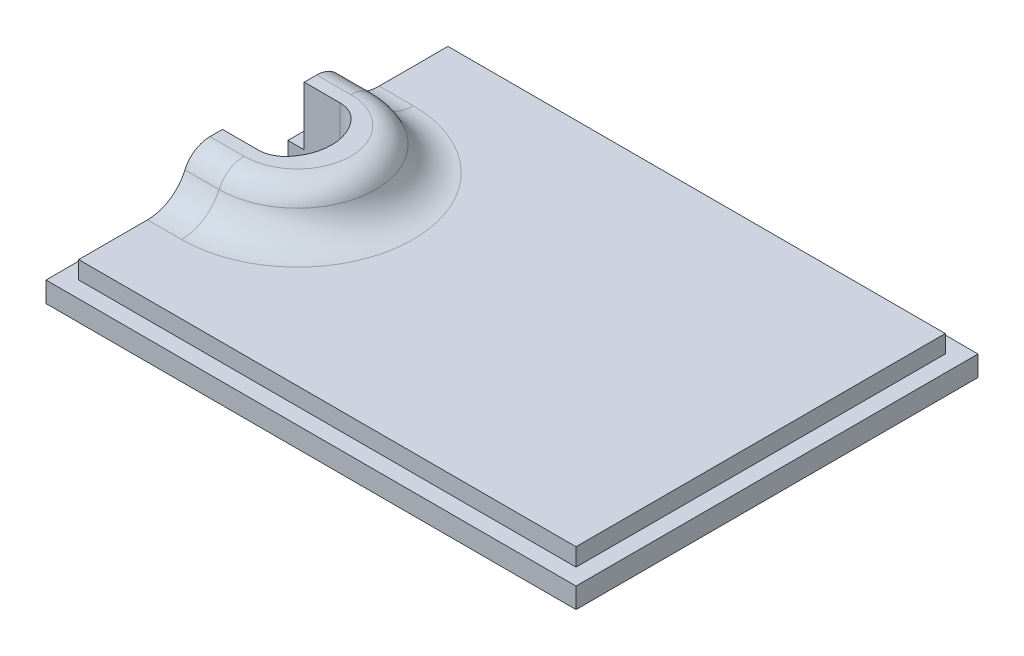
ISO-10303-21;
HEADER;
FILE_DESCRIPTION(('STEP AP214'),'2;1');
FILE_NAME('part.step','',(''),(''),'','','');
FILE_SCHEMA(('AUTOMOTIVE_DESIGN { 1 0 10303 214 1 1 1 1 }'));
ENDSEC;
DATA;
#1=APPLICATION_CONTEXT('core data for automotive mechanical design processes');
#2=APPLICATION_PROTOCOL_DEFINITION('international standard','automotive_design',2000,#1);
#3=PRODUCT_CONTEXT('',#1,'mechanical');
#4=PRODUCT('Part','Part','',(#3));
#5=PRODUCT_RELATED_PRODUCT_CATEGORY('part','',(#4));
#6=PRODUCT_DEFINITION_FORMATION('','',#4);
#7=PRODUCT_DEFINITION_CONTEXT('part definition',#1,'design');
#8=PRODUCT_DEFINITION('design','',#6,#7);
#9=PRODUCT_DEFINITION_SHAPE('','',#8);
#10=(LENGTH_UNIT() NAMED_UNIT(*) SI_UNIT(.MILLI.,.METRE.));
#11=(NAMED_UNIT(*) PLANE_ANGLE_UNIT() SI_UNIT($,.RADIAN.));
#12=(NAMED_UNIT(*) SI_UNIT($,.STERADIAN.) SOLID_ANGLE_UNIT());
#13=UNCERTAINTY_MEASURE_WITH_UNIT(LENGTH_MEASURE(1.E-05),#10,'distance_accuracy_value','');
#14=(GEOMETRIC_REPRESENTATION_CONTEXT(3) GLOBAL_UNCERTAINTY_ASSIGNED_CONTEXT((#13)) GLOBAL_UNIT_ASSIGNED_CONTEXT((#10,
#11,#12)) REPRESENTATION_CONTEXT('',''));
#15=CARTESIAN_POINT('',(0.,0.,0.));
#16=DIRECTION('',(0.,0.,1.));
#17=DIRECTION('',(1.,0.,0.));
#18=AXIS2_PLACEMENT_3D('',#15,#16,#17);
#19=CARTESIAN_POINT('',(-15.75,3.9,0.));
#20=DIRECTION('',(0.,1.,0.));
#21=DIRECTION('',(0.,0.,1.));
#22=AXIS2_PLACEMENT_3D('',#19,#20,#21);
#23=PLANE('',#22);
#24=CARTESIAN_POINT('',(-15.75,3.9,0.));
#25=DIRECTION('',(0.,1.,0.));
#26=DIRECTION('',(0.,0.,1.));
#27=AXIS2_PLACEMENT_3D('',#24,#25,#26);
#28=CIRCLE('',#27,8.5);
#29=CARTESIAN_POINT('',(-15.75,3.9,-8.5));
#30=VERTEX_POINT('',#29);
#31=CARTESIAN_POINT('',(-15.75,3.9,8.5));
#32=VERTEX_POINT('',#31);
#33=EDGE_CURVE('E376',#30,#32,#28,.F.);
#34=ORIENTED_EDGE('',*,*,#33,.T.);
#35=DIRECTION('',(1.,0.,0.));
#36=VECTOR('',#35,1.);
#37=CARTESIAN_POINT('',(-15.75,3.9,8.5));
#38=LINE('',#37,#36);
#39=CARTESIAN_POINT('',(-18.25,3.9,8.5));
#40=VERTEX_POINT('',#39);
#41=EDGE_CURVE('E393',#32,#40,#38,.F.);
#42=ORIENTED_EDGE('',*,*,#41,.T.);
#43=DIRECTION('',(0.,0.,-1.));
#44=VECTOR('',#43,1.);
#45=CARTESIAN_POINT('',(-18.25,3.9,0.));
#46=LINE('',#45,#44);
#47=CARTESIAN_POINT('',(-18.25,3.9,13.55));
#48=VERTEX_POINT('',#47);
#49=EDGE_CURVE('E299',#48,#40,#46,.T.);
#50=ORIENTED_EDGE('',*,*,#49,.F.);
#51=DIRECTION('',(-1.,0.,0.));
#52=VECTOR('',#51,1.);
#53=CARTESIAN_POINT('',(-15.75,3.9,13.55));
#54=LINE('',#53,#52);
#55=CARTESIAN_POINT('',(18.25,3.9,13.55));
#56=VERTEX_POINT('',#55);
#57=EDGE_CURVE('E293',#56,#48,#54,.T.);
#58=ORIENTED_EDGE('',*,*,#57,.F.);
#59=DIRECTION('',(0.,0.,1.));
#60=VECTOR('',#59,1.);
#61=CARTESIAN_POINT('',(18.25,3.9,0.));
#62=LINE('',#61,#60);
#63=CARTESIAN_POINT('',(18.25,3.9,-13.55));
#64=VERTEX_POINT('',#63);
#65=EDGE_CURVE('E291',#64,#56,#62,.T.);
#66=ORIENTED_EDGE('',*,*,#65,.F.);
#67=DIRECTION('',(1.,0.,0.));
#68=VECTOR('',#67,1.);
#69=CARTESIAN_POINT('',(-15.75,3.9,-13.55));
#70=LINE('',#69,#68);
#71=CARTESIAN_POINT('',(-18.25,3.9,-13.55));
#72=VERTEX_POINT('',#71);
#73=EDGE_CURVE('E276',#72,#64,#70,.T.);
#74=ORIENTED_EDGE('',*,*,#73,.F.);
#75=DIRECTION('',(0.,0.,-1.));
#76=VECTOR('',#75,1.);
#77=CARTESIAN_POINT('',(-18.25,3.9,0.));
#78=LINE('',#77,#76);
#79=CARTESIAN_POINT('',(-18.25,3.9,-8.5));
#80=VERTEX_POINT('',#79);
#81=EDGE_CURVE('E264',#80,#72,#78,.T.);
#82=ORIENTED_EDGE('',*,*,#81,.F.);
#83=DIRECTION('',(1.,0.,0.));
#84=VECTOR('',#83,1.);
#85=CARTESIAN_POINT('',(-15.75,3.9,-8.5));
#86=LINE('',#85,#84);
#87=EDGE_CURVE('E391',#80,#30,#86,.T.);
#88=ORIENTED_EDGE('',*,*,#87,.T.);
#89=EDGE_LOOP('',(#34,#42,#50,#58,#66,#74,#82,#88));
#90=FACE_BOUND('',#89,.T.);
#91=ADVANCED_FACE('F99',(#90),#23,.T.);
#92=CARTESIAN_POINT('',(-15.75,2.6,0.));
#93=DIRECTION('',(0.,1.,0.));
#94=DIRECTION('',(0.,0.,1.));
#95=AXIS2_PLACEMENT_3D('',#92,#93,#94);
#96=PLANE('',#95);
#97=DIRECTION('',(1.,0.,0.));
#98=VECTOR('',#97,1.);
#99=CARTESIAN_POINT('',(0.,2.6,-3.));
#100=LINE('',#99,#98);
#101=CARTESIAN_POINT('',(-19.45,2.6,-3.));
#102=VERTEX_POINT('',#101);
#103=CARTESIAN_POINT('',(-18.25,2.6,-3.));
#104=VERTEX_POINT('',#103);
#105=EDGE_CURVE('E324',#102,#104,#100,.T.);
#106=ORIENTED_EDGE('',*,*,#105,.T.);
#107=DIRECTION('',(0.,0.,-1.));
#108=VECTOR('',#107,1.);
#109=CARTESIAN_POINT('',(-18.25,2.6,0.));
#110=LINE('',#109,#108);
#111=CARTESIAN_POINT('',(-18.25,2.6,-13.55));
#112=VERTEX_POINT('',#111);
#113=EDGE_CURVE('E302',#104,#112,#110,.T.);
#114=ORIENTED_EDGE('',*,*,#113,.T.);
#115=DIRECTION('',(1.,0.,0.));
#116=VECTOR('',#115,1.);
#117=CARTESIAN_POINT('',(-15.75,2.6,-13.55));
#118=LINE('',#117,#116);
#119=CARTESIAN_POINT('',(18.25,2.6,-13.55));
#120=VERTEX_POINT('',#119);
#121=EDGE_CURVE('E283',#112,#120,#118,.T.);
#122=ORIENTED_EDGE('',*,*,#121,.T.);
#123=DIRECTION('',(0.,0.,1.));
#124=VECTOR('',#123,1.);
#125=CARTESIAN_POINT('',(18.25,2.6,0.));
#126=LINE('',#125,#124);
#127=CARTESIAN_POINT('',(18.25,2.6,13.55));
#128=VERTEX_POINT('',#127);
#129=EDGE_CURVE('E306',#120,#128,#126,.T.);
#130=ORIENTED_EDGE('',*,*,#129,.T.);
#131=DIRECTION('',(-1.,0.,0.));
#132=VECTOR('',#131,1.);
#133=CARTESIAN_POINT('',(-15.75,2.6,13.55));
#134=LINE('',#133,#132);
#135=CARTESIAN_POINT('',(-18.25,2.6,13.55));
#136=VERTEX_POINT('',#135);
#137=EDGE_CURVE('E309',#128,#136,#134,.T.);
#138=ORIENTED_EDGE('',*,*,#137,.T.);
#139=DIRECTION('',(0.,0.,-1.));
#140=VECTOR('',#139,1.);
#141=CARTESIAN_POINT('',(-18.25,2.6,0.));
#142=LINE('',#141,#140);
#143=CARTESIAN_POINT('',(-18.25,2.6,3.));
#144=VERTEX_POINT('',#143);
#145=EDGE_CURVE('E277',#136,#144,#142,.T.);
#146=ORIENTED_EDGE('',*,*,#145,.T.);
#147=DIRECTION('',(1.,0.,0.));
#148=VECTOR('',#147,1.);
#149=CARTESIAN_POINT('',(-1.,2.6,3.));
#150=LINE('',#149,#148);
#151=CARTESIAN_POINT('',(-19.45,2.6,3.));
#152=VERTEX_POINT('',#151);
#153=EDGE_CURVE('E336',#152,#144,#150,.T.);
#154=ORIENTED_EDGE('',*,*,#153,.F.);
#155=DIRECTION('',(0.,0.,-1.));
#156=VECTOR('',#155,1.);
#157=CARTESIAN_POINT('',(-19.45,2.6,0.));
#158=LINE('',#157,#156);
#159=CARTESIAN_POINT('',(-19.45,2.6,14.75));
#160=VERTEX_POINT('',#159);
#161=EDGE_CURVE('E333',#160,#152,#158,.T.);
#162=ORIENTED_EDGE('',*,*,#161,.F.);
#163=DIRECTION('',(-1.,0.,0.));
#164=VECTOR('',#163,1.);
#165=CARTESIAN_POINT('',(0.,2.6,14.75));
#166=LINE('',#165,#164);
#167=CARTESIAN_POINT('',(19.45,2.6,14.75));
#168=VERTEX_POINT('',#167);
#169=EDGE_CURVE('E330',#168,#160,#166,.T.);
#170=ORIENTED_EDGE('',*,*,#169,.F.);
#171=DIRECTION('',(0.,0.,1.));
#172=VECTOR('',#171,1.);
#173=CARTESIAN_POINT('',(19.45,2.6,0.));
#174=LINE('',#173,#172);
#175=CARTESIAN_POINT('',(19.45,2.6,-14.75));
#176=VERTEX_POINT('',#175);
#177=EDGE_CURVE('E327',#176,#168,#174,.T.);
#178=ORIENTED_EDGE('',*,*,#177,.F.);
#179=DIRECTION('',(1.,0.,0.));
#180=VECTOR('',#179,1.);
#181=CARTESIAN_POINT('',(0.,2.6,-14.75));
#182=LINE('',#181,#180);
#183=CARTESIAN_POINT('',(-19.45,2.6,-14.75));
#184=VERTEX_POINT('',#183);
#185=EDGE_CURVE('E323',#184,#176,#182,.T.);
#186=ORIENTED_EDGE('',*,*,#185,.F.);
#187=DIRECTION('',(0.,0.,-1.));
#188=VECTOR('',#187,1.);
#189=CARTESIAN_POINT('',(-19.45,2.6,0.));
#190=LINE('',#189,#188);
#191=EDGE_CURVE('E320',#102,#184,#190,.T.);
#192=ORIENTED_EDGE('',*,*,#191,.F.);
#193=EDGE_LOOP('',(#106,#114,#122,#130,#138,#146,#154,#162,#170,#178,#186,#192));
#194=FACE_BOUND('',#193,.T.);
#195=ADVANCED_FACE('F490',(#194),#96,.T.);
#196=CARTESIAN_POINT('',(0.,0.,0.));
#197=DIRECTION('',(0.,1.,0.));
#198=DIRECTION('',(0.,0.,1.));
#199=AXIS2_PLACEMENT_3D('',#196,#197,#198);
#200=PLANE('',#199);
#201=DIRECTION('',(-1.,0.,0.));
#202=VECTOR('',#201,1.);
#203=CARTESIAN_POINT('',(0.,0.,13.65));
#204=LINE('',#203,#202);
#205=CARTESIAN_POINT('',(18.35,0.,13.65));
#206=VERTEX_POINT('',#205);
#207=CARTESIAN_POINT('',(-18.35,0.,13.65));
#208=VERTEX_POINT('',#207);
#209=EDGE_CURVE('E354',#206,#208,#204,.T.);
#210=ORIENTED_EDGE('',*,*,#209,.T.);
#211=DIRECTION('',(0.,0.,-1.));
#212=VECTOR('',#211,1.);
#213=CARTESIAN_POINT('',(-18.35,0.,0.));
#214=LINE('',#213,#212);
#215=CARTESIAN_POINT('',(-18.35,0.,3.));
#216=VERTEX_POINT('',#215);
#217=EDGE_CURVE('E363',#208,#216,#214,.T.);
#218=ORIENTED_EDGE('',*,*,#217,.T.);
#219=DIRECTION('',(-1.,0.,0.));
#220=VECTOR('',#219,1.);
#221=CARTESIAN_POINT('',(-1.,0.,3.));
#222=LINE('',#221,#220);
#223=CARTESIAN_POINT('',(-15.6319660112501,0.,3.));
#224=VERTEX_POINT('',#223);
#225=EDGE_CURVE('E341',#224,#216,#222,.T.);
#226=ORIENTED_EDGE('',*,*,#225,.F.);
#227=CARTESIAN_POINT('',(-15.6319660112501,0.,1.));
#228=DIRECTION('',(0.,1.,0.));
#229=DIRECTION('',(0.,0.,1.));
#230=AXIS2_PLACEMENT_3D('',#227,#228,#229);
#231=CIRCLE('',#230,2.);
#232=CARTESIAN_POINT('',(-14.1412540262502,0.,2.33333333333333));
#233=VERTEX_POINT('',#232);
#234=EDGE_CURVE('E462',#224,#233,#231,.T.);
#235=ORIENTED_EDGE('',*,*,#234,.T.);
#236=CARTESIAN_POINT('',(-16.75,0.,0.));
#237=DIRECTION('',(0.,1.,0.));
#238=DIRECTION('',(0.,0.,1.));
#239=AXIS2_PLACEMENT_3D('',#236,#237,#238);
#240=CIRCLE('',#239,3.5);
#241=CARTESIAN_POINT('',(-14.1412540262502,0.,-2.33333333333333));
#242=VERTEX_POINT('',#241);
#243=EDGE_CURVE('E439',#242,#233,#240,.F.);
#244=ORIENTED_EDGE('',*,*,#243,.F.);
#245=CARTESIAN_POINT('',(-15.6319660112501,0.,-0.999999999999999));
#246=DIRECTION('',(0.,1.,0.));
#247=DIRECTION('',(0.,0.,1.));
#248=AXIS2_PLACEMENT_3D('',#245,#246,#247);
#249=CIRCLE('',#248,2.);
#250=CARTESIAN_POINT('',(-15.6319660112501,0.,-3.));
#251=VERTEX_POINT('',#250);
#252=EDGE_CURVE('E107',#242,#251,#249,.T.);
#253=ORIENTED_EDGE('',*,*,#252,.T.);
#254=DIRECTION('',(-1.,0.,0.));
#255=VECTOR('',#254,1.);
#256=CARTESIAN_POINT('',(0.,0.,-3.));
#257=LINE('',#256,#255);
#258=CARTESIAN_POINT('',(-18.35,0.,-3.));
#259=VERTEX_POINT('',#258);
#260=EDGE_CURVE('E434',#251,#259,#257,.T.);
#261=ORIENTED_EDGE('',*,*,#260,.T.);
#262=DIRECTION('',(0.,0.,-1.));
#263=VECTOR('',#262,1.);
#264=CARTESIAN_POINT('',(-18.35,0.,0.));
#265=LINE('',#264,#263);
#266=CARTESIAN_POINT('',(-18.35,0.,-13.65));
#267=VERTEX_POINT('',#266);
#268=EDGE_CURVE('E361',#259,#267,#265,.T.);
#269=ORIENTED_EDGE('',*,*,#268,.T.);
#270=DIRECTION('',(1.,0.,0.));
#271=VECTOR('',#270,1.);
#272=CARTESIAN_POINT('',(0.,0.,-13.65));
#273=LINE('',#272,#271);
#274=CARTESIAN_POINT('',(18.35,0.,-13.65));
#275=VERTEX_POINT('',#274);
#276=EDGE_CURVE('E359',#267,#275,#273,.T.);
#277=ORIENTED_EDGE('',*,*,#276,.T.);
#278=DIRECTION('',(0.,0.,1.));
#279=VECTOR('',#278,1.);
#280=CARTESIAN_POINT('',(18.35,0.,0.));
#281=LINE('',#280,#279);
#282=EDGE_CURVE('E357',#275,#206,#281,.T.);
#283=ORIENTED_EDGE('',*,*,#282,.T.);
#284=EDGE_LOOP('',(#210,#218,#226,#235,#244,#253,#261,#269,#277,#283));
#285=FACE_BOUND('',#284,.T.);
#286=ADVANCED_FACE('F479',(#285),#200,.F.);
#287=CARTESIAN_POINT('',(-16.75,1.,0.));
#288=DIRECTION('',(0.,-1.,0.));
#289=DIRECTION('',(0.,0.,-1.));
#290=AXIS2_PLACEMENT_3D('',#287,#288,#289);
#291=CYLINDRICAL_SURFACE('',#290,3.5);
#292=ORIENTED_EDGE('',*,*,#243,.T.);
#293=DIRECTION('',(0.,-1.,0.));
#294=VECTOR('',#293,1.);
#295=CARTESIAN_POINT('',(-14.1412540262502,1.,2.33333333333333));
#296=LINE('',#295,#294);
#297=CARTESIAN_POINT('',(-14.1412540262502,6.9,2.33333333333333));
#298=VERTEX_POINT('',#297);
#299=EDGE_CURVE('E459',#233,#298,#296,.F.);
#300=ORIENTED_EDGE('',*,*,#299,.T.);
#301=CARTESIAN_POINT('',(-16.75,6.9,0.));
#302=DIRECTION('',(0.,1.,0.));
#303=DIRECTION('',(0.,0.,1.));
#304=AXIS2_PLACEMENT_3D('',#301,#302,#303);
#305=CIRCLE('',#304,3.5);
#306=CARTESIAN_POINT('',(-14.1412540262502,6.9,-2.33333333333333));
#307=VERTEX_POINT('',#306);
#308=EDGE_CURVE('E430',#298,#307,#305,.T.);
#309=ORIENTED_EDGE('',*,*,#308,.T.);
#310=DIRECTION('',(0.,-1.,0.));
#311=VECTOR('',#310,1.);
#312=CARTESIAN_POINT('',(-14.1412540262502,1.,-2.33333333333333));
#313=LINE('',#312,#311);
#314=EDGE_CURVE('E456',#307,#242,#313,.T.);
#315=ORIENTED_EDGE('',*,*,#314,.T.);
#316=EDGE_LOOP('',(#292,#300,#309,#315));
#317=FACE_BOUND('',#316,.T.);
#318=ADVANCED_FACE('F481',(#317),#291,.F.);
#319=CARTESIAN_POINT('',(0.,1.,-3.));
#320=DIRECTION('',(0.,0.,1.));
#321=DIRECTION('',(1.,0.,0.));
#322=AXIS2_PLACEMENT_3D('',#319,#320,#321);
#323=PLANE('',#322);
#324=ORIENTED_EDGE('',*,*,#260,.F.);
#325=DIRECTION('',(0.,-1.,0.));
#326=VECTOR('',#325,1.);
#327=CARTESIAN_POINT('',(-15.6319660112501,1.,-3.));
#328=LINE('',#327,#326);
#329=CARTESIAN_POINT('',(-15.6319660112501,6.9,-3.));
#330=VERTEX_POINT('',#329);
#331=EDGE_CURVE('E114',#251,#330,#328,.F.);
#332=ORIENTED_EDGE('',*,*,#331,.T.);
#333=DIRECTION('',(1.,0.,0.));
#334=VECTOR('',#333,1.);
#335=CARTESIAN_POINT('',(-15.75,6.9,-3.));
#336=LINE('',#335,#334);
#337=CARTESIAN_POINT('',(-18.25,6.9,-3.));
#338=VERTEX_POINT('',#337);
#339=EDGE_CURVE('E445',#338,#330,#336,.T.);
#340=ORIENTED_EDGE('',*,*,#339,.F.);
#341=DIRECTION('',(0.,-1.,0.));
#342=VECTOR('',#341,1.);
#343=CARTESIAN_POINT('',(-18.25,3.9,-3.));
#344=LINE('',#343,#342);
#345=EDGE_CURVE('E286',#338,#104,#344,.T.);
#346=ORIENTED_EDGE('',*,*,#345,.T.);
#347=ORIENTED_EDGE('',*,*,#105,.F.);
#348=DIRECTION('',(0.,-1.,0.));
#349=VECTOR('',#348,1.);
#350=CARTESIAN_POINT('',(-19.45,1.,-3.));
#351=LINE('',#350,#349);
#352=CARTESIAN_POINT('',(-19.45,1.1,-3.));
#353=VERTEX_POINT('',#352);
#354=EDGE_CURVE('E355',#102,#353,#351,.T.);
#355=ORIENTED_EDGE('',*,*,#354,.T.);
#356=DIRECTION('',(-0.70710678118655,0.707106781186545,0.));
#357=VECTOR('',#356,1.);
#358=CARTESIAN_POINT('',(-9.67499999999993,-8.675,-3.));
#359=LINE('',#358,#357);
#360=EDGE_CURVE('E369',#353,#259,#359,.F.);
#361=ORIENTED_EDGE('',*,*,#360,.T.);
#362=EDGE_LOOP('',(#324,#332,#340,#346,#347,#355,#361));
#363=FACE_BOUND('',#362,.T.);
#364=ADVANCED_FACE('F486',(#363),#323,.T.);
#365=CARTESIAN_POINT('',(-19.45,1.,0.));
#366=DIRECTION('',(1.,0.,0.));
#367=DIRECTION('',(0.,0.,-1.));
#368=AXIS2_PLACEMENT_3D('',#365,#366,#367);
#369=PLANE('',#368);
#370=DIRECTION('',(0.,-1.,0.));
#371=VECTOR('',#370,1.);
#372=CARTESIAN_POINT('',(-19.45,1.,-14.75));
#373=LINE('',#372,#371);
#374=CARTESIAN_POINT('',(-19.45,1.1,-14.75));
#375=VERTEX_POINT('',#374);
#376=EDGE_CURVE('E337',#184,#375,#373,.T.);
#377=ORIENTED_EDGE('',*,*,#376,.T.);
#378=DIRECTION('',(0.,0.,1.));
#379=VECTOR('',#378,1.);
#380=CARTESIAN_POINT('',(-19.45,1.1,0.));
#381=LINE('',#380,#379);
#382=EDGE_CURVE('E367',#375,#353,#381,.T.);
#383=ORIENTED_EDGE('',*,*,#382,.T.);
#384=ORIENTED_EDGE('',*,*,#354,.F.);
#385=ORIENTED_EDGE('',*,*,#191,.T.);
#386=EDGE_LOOP('',(#377,#383,#384,#385));
#387=FACE_BOUND('',#386,.T.);
#388=ADVANCED_FACE('F494',(#387),#369,.F.);
#389=CARTESIAN_POINT('',(0.,1.,-14.75));
#390=DIRECTION('',(0.,0.,1.));
#391=DIRECTION('',(1.,0.,0.));
#392=AXIS2_PLACEMENT_3D('',#389,#390,#391);
#393=PLANE('',#392);
#394=DIRECTION('',(0.,-1.,0.));
#395=VECTOR('',#394,1.);
#396=CARTESIAN_POINT('',(19.45,1.,-14.75));
#397=LINE('',#396,#395);
#398=CARTESIAN_POINT('',(19.45,1.1,-14.75));
#399=VERTEX_POINT('',#398);
#400=EDGE_CURVE('E340',#176,#399,#397,.T.);
#401=ORIENTED_EDGE('',*,*,#400,.T.);
#402=DIRECTION('',(-1.,0.,0.));
#403=VECTOR('',#402,1.);
#404=CARTESIAN_POINT('',(0.,1.1,-14.75));
#405=LINE('',#404,#403);
#406=EDGE_CURVE('E370',#399,#375,#405,.T.);
#407=ORIENTED_EDGE('',*,*,#406,.T.);
#408=ORIENTED_EDGE('',*,*,#376,.F.);
#409=ORIENTED_EDGE('',*,*,#185,.T.);
#410=EDGE_LOOP('',(#401,#407,#408,#409));
#411=FACE_BOUND('',#410,.T.);
#412=ADVANCED_FACE('F591',(#411),#393,.F.);
#413=CARTESIAN_POINT('',(19.45,1.,0.));
#414=DIRECTION('',(-1.,0.,0.));
#415=DIRECTION('',(0.,0.,1.));
#416=AXIS2_PLACEMENT_3D('',#413,#414,#415);
#417=PLANE('',#416);
#418=DIRECTION('',(0.,-1.,0.));
#419=VECTOR('',#418,1.);
#420=CARTESIAN_POINT('',(19.45,1.,14.75));
#421=LINE('',#420,#419);
#422=CARTESIAN_POINT('',(19.45,1.1,14.75));
#423=VERTEX_POINT('',#422);
#424=EDGE_CURVE('E344',#168,#423,#421,.T.);
#425=ORIENTED_EDGE('',*,*,#424,.T.);
#426=DIRECTION('',(0.,0.,-1.));
#427=VECTOR('',#426,1.);
#428=CARTESIAN_POINT('',(19.45,1.1,0.));
#429=LINE('',#428,#427);
#430=EDGE_CURVE('E372',#423,#399,#429,.T.);
#431=ORIENTED_EDGE('',*,*,#430,.T.);
#432=ORIENTED_EDGE('',*,*,#400,.F.);
#433=ORIENTED_EDGE('',*,*,#177,.T.);
#434=EDGE_LOOP('',(#425,#431,#432,#433));
#435=FACE_BOUND('',#434,.T.);
#436=ADVANCED_FACE('F594',(#435),#417,.F.);
#437=CARTESIAN_POINT('',(0.,1.,14.75));
#438=DIRECTION('',(0.,0.,-1.));
#439=DIRECTION('',(-1.,0.,0.));
#440=AXIS2_PLACEMENT_3D('',#437,#438,#439);
#441=PLANE('',#440);
#442=DIRECTION('',(0.,-1.,0.));
#443=VECTOR('',#442,1.);
#444=CARTESIAN_POINT('',(-19.45,1.,14.75));
#445=LINE('',#444,#443);
#446=CARTESIAN_POINT('',(-19.45,1.1,14.75));
#447=VERTEX_POINT('',#446);
#448=EDGE_CURVE('E347',#160,#447,#445,.T.);
#449=ORIENTED_EDGE('',*,*,#448,.T.);
#450=DIRECTION('',(1.,0.,0.));
#451=VECTOR('',#450,1.);
#452=CARTESIAN_POINT('',(0.,1.1,14.75));
#453=LINE('',#452,#451);
#454=EDGE_CURVE('E374',#447,#423,#453,.T.);
#455=ORIENTED_EDGE('',*,*,#454,.T.);
#456=ORIENTED_EDGE('',*,*,#424,.F.);
#457=ORIENTED_EDGE('',*,*,#169,.T.);
#458=EDGE_LOOP('',(#449,#455,#456,#457));
#459=FACE_BOUND('',#458,.T.);
#460=ADVANCED_FACE('F598',(#459),#441,.F.);
#461=CARTESIAN_POINT('',(-19.45,1.,0.));
#462=DIRECTION('',(1.,0.,0.));
#463=DIRECTION('',(0.,0.,-1.));
#464=AXIS2_PLACEMENT_3D('',#461,#462,#463);
#465=PLANE('',#464);
#466=DIRECTION('',(0.,-1.,0.));
#467=VECTOR('',#466,1.);
#468=CARTESIAN_POINT('',(-19.45,1.,3.));
#469=LINE('',#468,#467);
#470=CARTESIAN_POINT('',(-19.45,1.1,3.));
#471=VERTEX_POINT('',#470);
#472=EDGE_CURVE('E350',#152,#471,#469,.T.);
#473=ORIENTED_EDGE('',*,*,#472,.T.);
#474=DIRECTION('',(0.,0.,1.));
#475=VECTOR('',#474,1.);
#476=CARTESIAN_POINT('',(-19.45,1.1,0.));
#477=LINE('',#476,#475);
#478=EDGE_CURVE('E351',#471,#447,#477,.T.);
#479=ORIENTED_EDGE('',*,*,#478,.T.);
#480=ORIENTED_EDGE('',*,*,#448,.F.);
#481=ORIENTED_EDGE('',*,*,#161,.T.);
#482=EDGE_LOOP('',(#473,#479,#480,#481));
#483=FACE_BOUND('',#482,.T.);
#484=ADVANCED_FACE('F522',(#483),#465,.F.);
#485=CARTESIAN_POINT('',(-1.,1.,3.));
#486=DIRECTION('',(0.,0.,1.));
#487=DIRECTION('',(1.,0.,0.));
#488=AXIS2_PLACEMENT_3D('',#485,#486,#487);
#489=PLANE('',#488);
#490=DIRECTION('',(1.,0.,0.));
#491=VECTOR('',#490,1.);
#492=CARTESIAN_POINT('',(-16.75,6.9,3.));
#493=LINE('',#492,#491);
#494=CARTESIAN_POINT('',(-18.25,6.9,3.));
#495=VERTEX_POINT('',#494);
#496=CARTESIAN_POINT('',(-15.6319660112501,6.9,3.));
#497=VERTEX_POINT('',#496);
#498=EDGE_CURVE('E427',#495,#497,#493,.T.);
#499=ORIENTED_EDGE('',*,*,#498,.T.);
#500=DIRECTION('',(0.,1.,0.));
#501=VECTOR('',#500,1.);
#502=CARTESIAN_POINT('',(-15.6319660112501,0.,3.));
#503=LINE('',#502,#501);
#504=EDGE_CURVE('E422',#497,#224,#503,.F.);
#505=ORIENTED_EDGE('',*,*,#504,.T.);
#506=ORIENTED_EDGE('',*,*,#225,.T.);
#507=DIRECTION('',(0.70710678118655,-0.707106781186545,0.));
#508=VECTOR('',#507,1.);
#509=CARTESIAN_POINT('',(-19.45,1.1,3.));
#510=LINE('',#509,#508);
#511=EDGE_CURVE('E366',#216,#471,#510,.F.);
#512=ORIENTED_EDGE('',*,*,#511,.T.);
#513=ORIENTED_EDGE('',*,*,#472,.F.);
#514=ORIENTED_EDGE('',*,*,#153,.T.);
#515=DIRECTION('',(0.,-1.,0.));
#516=VECTOR('',#515,1.);
#517=CARTESIAN_POINT('',(-18.25,1.,3.));
#518=LINE('',#517,#516);
#519=EDGE_CURVE('E316',#495,#144,#518,.T.);
#520=ORIENTED_EDGE('',*,*,#519,.F.);
#521=EDGE_LOOP('',(#499,#505,#506,#512,#513,#514,#520));
#522=FACE_BOUND('',#521,.T.);
#523=ADVANCED_FACE('F476',(#522),#489,.F.);
#524=CARTESIAN_POINT('',(-18.25,3.9,0.));
#525=DIRECTION('',(-1.,0.,0.));
#526=DIRECTION('',(0.,0.,1.));
#527=AXIS2_PLACEMENT_3D('',#524,#525,#526);
#528=PLANE('',#527);
#529=CARTESIAN_POINT('',(-18.25,6.9,8.5));
#530=DIRECTION('',(-1.,0.,0.));
#531=DIRECTION('',(0.,0.,1.));
#532=AXIS2_PLACEMENT_3D('',#529,#530,#531);
#533=CIRCLE('',#532,3.);
#534=CARTESIAN_POINT('',(-18.25,5.7,5.7504545830265));
#535=VERTEX_POINT('',#534);
#536=EDGE_CURVE('E395',#40,#535,#533,.F.);
#537=ORIENTED_EDGE('',*,*,#536,.T.);
#538=CARTESIAN_POINT('',(-18.25,4.9,3.91742430504416));
#539=DIRECTION('',(-1.,0.,0.));
#540=DIRECTION('',(0.,0.,1.));
#541=AXIS2_PLACEMENT_3D('',#538,#539,#540);
#542=CIRCLE('',#541,2.);
#543=CARTESIAN_POINT('',(-18.25,6.9,3.91742430504416));
#544=VERTEX_POINT('',#543);
#545=EDGE_CURVE('E418',#535,#544,#542,.T.);
#546=ORIENTED_EDGE('',*,*,#545,.T.);
#547=DIRECTION('',(0.,0.,-1.));
#548=VECTOR('',#547,1.);
#549=CARTESIAN_POINT('',(-18.25,6.9,0.));
#550=LINE('',#549,#548);
#551=EDGE_CURVE('E389',#544,#495,#550,.T.);
#552=ORIENTED_EDGE('',*,*,#551,.T.);
#553=ORIENTED_EDGE('',*,*,#519,.T.);
#554=ORIENTED_EDGE('',*,*,#145,.F.);
#555=DIRECTION('',(0.,-1.,0.));
#556=VECTOR('',#555,1.);
#557=CARTESIAN_POINT('',(-18.25,3.9,13.55));
#558=LINE('',#557,#556);
#559=EDGE_CURVE('E314',#48,#136,#558,.T.);
#560=ORIENTED_EDGE('',*,*,#559,.F.);
#561=ORIENTED_EDGE('',*,*,#49,.T.);
#562=EDGE_LOOP('',(#537,#546,#552,#553,#554,#560,#561));
#563=FACE_BOUND('',#562,.T.);
#564=ADVANCED_FACE('F529',(#563),#528,.T.);
#565=CARTESIAN_POINT('',(-15.75,3.9,13.55));
#566=DIRECTION('',(0.,0.,1.));
#567=DIRECTION('',(1.,0.,0.));
#568=AXIS2_PLACEMENT_3D('',#565,#566,#567);
#569=PLANE('',#568);
#570=ORIENTED_EDGE('',*,*,#137,.F.);
#571=DIRECTION('',(0.,-1.,0.));
#572=VECTOR('',#571,1.);
#573=CARTESIAN_POINT('',(18.25,3.9,13.55));
#574=LINE('',#573,#572);
#575=EDGE_CURVE('E317',#56,#128,#574,.T.);
#576=ORIENTED_EDGE('',*,*,#575,.F.);
#577=ORIENTED_EDGE('',*,*,#57,.T.);
#578=ORIENTED_EDGE('',*,*,#559,.T.);
#579=EDGE_LOOP('',(#570,#576,#577,#578));
#580=FACE_BOUND('',#579,.T.);
#581=ADVANCED_FACE('F577',(#580),#569,.T.);
#582=CARTESIAN_POINT('',(18.25,3.9,0.));
#583=DIRECTION('',(1.,0.,0.));
#584=DIRECTION('',(0.,0.,-1.));
#585=AXIS2_PLACEMENT_3D('',#582,#583,#584);
#586=PLANE('',#585);
#587=ORIENTED_EDGE('',*,*,#129,.F.);
#588=DIRECTION('',(0.,-1.,0.));
#589=VECTOR('',#588,1.);
#590=CARTESIAN_POINT('',(18.25,3.9,-13.55));
#591=LINE('',#590,#589);
#592=EDGE_CURVE('E285',#64,#120,#591,.T.);
#593=ORIENTED_EDGE('',*,*,#592,.F.);
#594=ORIENTED_EDGE('',*,*,#65,.T.);
#595=ORIENTED_EDGE('',*,*,#575,.T.);
#596=EDGE_LOOP('',(#587,#593,#594,#595));
#597=FACE_BOUND('',#596,.T.);
#598=ADVANCED_FACE('F580',(#597),#586,.T.);
#599=CARTESIAN_POINT('',(-15.75,3.9,-13.55));
#600=DIRECTION('',(0.,0.,-1.));
#601=DIRECTION('',(-1.,0.,0.));
#602=AXIS2_PLACEMENT_3D('',#599,#600,#601);
#603=PLANE('',#602);
#604=ORIENTED_EDGE('',*,*,#121,.F.);
#605=DIRECTION('',(0.,-1.,0.));
#606=VECTOR('',#605,1.);
#607=CARTESIAN_POINT('',(-18.25,3.9,-13.55));
#608=LINE('',#607,#606);
#609=EDGE_CURVE('E269',#72,#112,#608,.T.);
#610=ORIENTED_EDGE('',*,*,#609,.F.);
#611=ORIENTED_EDGE('',*,*,#73,.T.);
#612=ORIENTED_EDGE('',*,*,#592,.T.);
#613=EDGE_LOOP('',(#604,#610,#611,#612));
#614=FACE_BOUND('',#613,.T.);
#615=ADVANCED_FACE('F281',(#614),#603,.T.);
#616=CARTESIAN_POINT('',(-18.25,3.9,0.));
#617=DIRECTION('',(-1.,0.,0.));
#618=DIRECTION('',(0.,0.,1.));
#619=AXIS2_PLACEMENT_3D('',#616,#617,#618);
#620=PLANE('',#619);
#621=DIRECTION('',(0.,0.,-1.));
#622=VECTOR('',#621,1.);
#623=CARTESIAN_POINT('',(-18.25,6.9,0.));
#624=LINE('',#623,#622);
#625=CARTESIAN_POINT('',(-18.25,6.9,-3.91742430504416));
#626=VERTEX_POINT('',#625);
#627=EDGE_CURVE('E304',#338,#626,#624,.T.);
#628=ORIENTED_EDGE('',*,*,#627,.T.);
#629=CARTESIAN_POINT('',(-18.25,4.9,-3.91742430504416));
#630=DIRECTION('',(-1.,0.,0.));
#631=DIRECTION('',(0.,0.,1.));
#632=AXIS2_PLACEMENT_3D('',#629,#630,#631);
#633=CIRCLE('',#632,2.);
#634=CARTESIAN_POINT('',(-18.25,5.7,-5.7504545830265));
#635=VERTEX_POINT('',#634);
#636=EDGE_CURVE('E414',#626,#635,#633,.T.);
#637=ORIENTED_EDGE('',*,*,#636,.T.);
#638=CARTESIAN_POINT('',(-18.25,6.9,-8.5));
#639=DIRECTION('',(-1.,0.,0.));
#640=DIRECTION('',(0.,0.,1.));
#641=AXIS2_PLACEMENT_3D('',#638,#639,#640);
#642=CIRCLE('',#641,3.);
#643=EDGE_CURVE('E272',#635,#80,#642,.F.);
#644=ORIENTED_EDGE('',*,*,#643,.T.);
#645=ORIENTED_EDGE('',*,*,#81,.T.);
#646=ORIENTED_EDGE('',*,*,#609,.T.);
#647=ORIENTED_EDGE('',*,*,#113,.F.);
#648=ORIENTED_EDGE('',*,*,#345,.F.);
#649=EDGE_LOOP('',(#628,#637,#644,#645,#646,#647,#648));
#650=FACE_BOUND('',#649,.T.);
#651=ADVANCED_FACE('F267',(#650),#620,.T.);
#652=CARTESIAN_POINT('',(-15.75,6.9,0.));
#653=DIRECTION('',(0.,1.,0.));
#654=DIRECTION('',(0.,0.,1.));
#655=AXIS2_PLACEMENT_3D('',#652,#653,#654);
#656=PLANE('',#655);
#657=CARTESIAN_POINT('',(-15.75,6.9,0.));
#658=DIRECTION('',(0.,1.,0.));
#659=DIRECTION('',(0.,0.,1.));
#660=AXIS2_PLACEMENT_3D('',#657,#658,#659);
#661=CIRCLE('',#660,3.91742430504416);
#662=CARTESIAN_POINT('',(-15.75,6.9,3.91742430504416));
#663=VERTEX_POINT('',#662);
#664=CARTESIAN_POINT('',(-15.75,6.9,-3.91742430504416));
#665=VERTEX_POINT('',#664);
#666=EDGE_CURVE('E408',#663,#665,#661,.T.);
#667=ORIENTED_EDGE('',*,*,#666,.T.);
#668=DIRECTION('',(1.,0.,0.));
#669=VECTOR('',#668,1.);
#670=CARTESIAN_POINT('',(-18.25,6.9,-3.91742430504416));
#671=LINE('',#670,#669);
#672=EDGE_CURVE('E412',#665,#626,#671,.F.);
#673=ORIENTED_EDGE('',*,*,#672,.T.);
#674=ORIENTED_EDGE('',*,*,#627,.F.);
#675=ORIENTED_EDGE('',*,*,#339,.T.);
#676=CARTESIAN_POINT('',(-15.6319660112501,6.9,-0.999999999999999));
#677=DIRECTION('',(0.,1.,0.));
#678=DIRECTION('',(0.,0.,1.));
#679=AXIS2_PLACEMENT_3D('',#676,#677,#678);
#680=CIRCLE('',#679,2.);
#681=EDGE_CURVE('E13',#330,#307,#680,.F.);
#682=ORIENTED_EDGE('',*,*,#681,.T.);
#683=ORIENTED_EDGE('',*,*,#308,.F.);
#684=CARTESIAN_POINT('',(-15.6319660112501,6.9,1.));
#685=DIRECTION('',(0.,1.,0.));
#686=DIRECTION('',(0.,0.,1.));
#687=AXIS2_PLACEMENT_3D('',#684,#685,#686);
#688=CIRCLE('',#687,2.);
#689=EDGE_CURVE('E464',#298,#497,#688,.F.);
#690=ORIENTED_EDGE('',*,*,#689,.T.);
#691=ORIENTED_EDGE('',*,*,#498,.F.);
#692=ORIENTED_EDGE('',*,*,#551,.F.);
#693=DIRECTION('',(-1.,0.,0.));
#694=VECTOR('',#693,1.);
#695=CARTESIAN_POINT('',(-15.75,6.9,3.91742430504416));
#696=LINE('',#695,#694);
#697=EDGE_CURVE('E410',#544,#663,#696,.F.);
#698=ORIENTED_EDGE('',*,*,#697,.T.);
#699=EDGE_LOOP('',(#667,#673,#674,#675,#682,#683,#690,#691,#692,#698));
#700=FACE_BOUND('',#699,.T.);
#701=ADVANCED_FACE('F469',(#700),#656,.T.);
#702=CARTESIAN_POINT('',(-19.45,1.1,0.));
#703=DIRECTION('',(0.707106781186545,0.70710678118655,0.));
#704=DIRECTION('',(0.,0.,1.));
#705=AXIS2_PLACEMENT_3D('',#702,#703,#704);
#706=PLANE('',#705);
#707=ORIENTED_EDGE('',*,*,#360,.F.);
#708=ORIENTED_EDGE('',*,*,#382,.F.);
#709=DIRECTION('',(-0.577350269189627,0.577350269189623,-0.577350269189627));
#710=VECTOR('',#709,1.);
#711=CARTESIAN_POINT('',(-12.9666666666666,-5.38333333333332,-8.26666666666664));
#712=LINE('',#711,#710);
#713=EDGE_CURVE('E386',#267,#375,#712,.T.);
#714=ORIENTED_EDGE('',*,*,#713,.F.);
#715=ORIENTED_EDGE('',*,*,#268,.F.);
#716=EDGE_LOOP('',(#707,#708,#714,#715));
#717=FACE_BOUND('',#716,.T.);
#718=ADVANCED_FACE('F499',(#717),#706,.F.);
#719=CARTESIAN_POINT('',(0.,1.1,-14.75));
#720=DIRECTION('',(0.,0.70710678118655,0.707106781186545));
#721=DIRECTION('',(-1.,0.,0.));
#722=AXIS2_PLACEMENT_3D('',#719,#720,#721);
#723=PLANE('',#722);
#724=ORIENTED_EDGE('',*,*,#713,.T.);
#725=ORIENTED_EDGE('',*,*,#406,.F.);
#726=DIRECTION('',(0.577350269189627,0.577350269189623,-0.577350269189627));
#727=VECTOR('',#726,1.);
#728=CARTESIAN_POINT('',(14.5333333333333,-3.81666666666666,-9.83333333333331));
#729=LINE('',#728,#727);
#730=EDGE_CURVE('E383',#275,#399,#729,.T.);
#731=ORIENTED_EDGE('',*,*,#730,.F.);
#732=ORIENTED_EDGE('',*,*,#276,.F.);
#733=EDGE_LOOP('',(#724,#725,#731,#732));
#734=FACE_BOUND('',#733,.T.);
#735=ADVANCED_FACE('F507',(#734),#723,.F.);
#736=CARTESIAN_POINT('',(19.45,1.1,0.));
#737=DIRECTION('',(-0.707106781186545,0.70710678118655,0.));
#738=DIRECTION('',(0.,0.,-1.));
#739=AXIS2_PLACEMENT_3D('',#736,#737,#738);
#740=PLANE('',#739);
#741=ORIENTED_EDGE('',*,*,#730,.T.);
#742=ORIENTED_EDGE('',*,*,#430,.F.);
#743=DIRECTION('',(0.577350269189627,0.577350269189623,0.577350269189627));
#744=VECTOR('',#743,1.);
#745=CARTESIAN_POINT('',(12.9666666666666,-5.38333333333332,8.26666666666664));
#746=LINE('',#745,#744);
#747=EDGE_CURVE('E379',#206,#423,#746,.T.);
#748=ORIENTED_EDGE('',*,*,#747,.F.);
#749=ORIENTED_EDGE('',*,*,#282,.F.);
#750=EDGE_LOOP('',(#741,#742,#748,#749));
#751=FACE_BOUND('',#750,.T.);
#752=ADVANCED_FACE('F510',(#751),#740,.F.);
#753=CARTESIAN_POINT('',(0.,1.1,14.75));
#754=DIRECTION('',(0.,0.70710678118655,-0.707106781186545));
#755=DIRECTION('',(1.,0.,0.));
#756=AXIS2_PLACEMENT_3D('',#753,#754,#755);
#757=PLANE('',#756);
#758=ORIENTED_EDGE('',*,*,#747,.T.);
#759=ORIENTED_EDGE('',*,*,#454,.F.);
#760=DIRECTION('',(0.577350269189627,-0.577350269189623,-0.577350269189627));
#761=VECTOR('',#760,1.);
#762=CARTESIAN_POINT('',(-12.9666666666666,-5.38333333333332,8.26666666666664));
#763=LINE('',#762,#761);
#764=EDGE_CURVE('E377',#208,#447,#763,.F.);
#765=ORIENTED_EDGE('',*,*,#764,.F.);
#766=ORIENTED_EDGE('',*,*,#209,.F.);
#767=EDGE_LOOP('',(#758,#759,#765,#766));
#768=FACE_BOUND('',#767,.T.);
#769=ADVANCED_FACE('F515',(#768),#757,.F.);
#770=CARTESIAN_POINT('',(-19.45,1.1,0.));
#771=DIRECTION('',(0.707106781186545,0.70710678118655,0.));
#772=DIRECTION('',(0.,0.,1.));
#773=AXIS2_PLACEMENT_3D('',#770,#771,#772);
#774=PLANE('',#773);
#775=ORIENTED_EDGE('',*,*,#511,.F.);
#776=ORIENTED_EDGE('',*,*,#217,.F.);
#777=ORIENTED_EDGE('',*,*,#764,.T.);
#778=ORIENTED_EDGE('',*,*,#478,.F.);
#779=EDGE_LOOP('',(#775,#776,#777,#778));
#780=FACE_BOUND('',#779,.T.);
#781=ADVANCED_FACE('F519',(#780),#774,.F.);
#782=CARTESIAN_POINT('',(-15.75,6.9,-8.5));
#783=DIRECTION('',(-1.,0.,0.));
#784=DIRECTION('',(0.,0.,1.));
#785=AXIS2_PLACEMENT_3D('',#782,#783,#784);
#786=CYLINDRICAL_SURFACE('',#785,3.);
#787=ORIENTED_EDGE('',*,*,#643,.F.);
#788=DIRECTION('',(-1.,0.,0.));
#789=VECTOR('',#788,1.);
#790=CARTESIAN_POINT('',(-15.75,5.7,-5.7504545830265));
#791=LINE('',#790,#789);
#792=CARTESIAN_POINT('',(-15.75,5.7,-5.7504545830265));
#793=VERTEX_POINT('',#792);
#794=EDGE_CURVE('E399',#635,#793,#791,.F.);
#795=ORIENTED_EDGE('',*,*,#794,.T.);
#796=CARTESIAN_POINT('',(-15.75,6.9,-8.5));
#797=DIRECTION('',(-1.,0.,0.));
#798=DIRECTION('',(0.,0.,1.));
#799=AXIS2_PLACEMENT_3D('',#796,#797,#798);
#800=CIRCLE('',#799,3.);
#801=EDGE_CURVE('E380',#30,#793,#800,.T.);
#802=ORIENTED_EDGE('',*,*,#801,.F.);
#803=ORIENTED_EDGE('',*,*,#87,.F.);
#804=EDGE_LOOP('',(#787,#795,#802,#803));
#805=FACE_BOUND('',#804,.T.);
#806=ADVANCED_FACE('F543',(#805),#786,.F.);
#807=CARTESIAN_POINT('',(-15.75,6.9,0.));
#808=DIRECTION('',(0.,1.,0.));
#809=DIRECTION('',(0.,0.,1.));
#810=AXIS2_PLACEMENT_3D('',#807,#808,#809);
#811=TOROIDAL_SURFACE('',#810,8.5,3.);
#812=ORIENTED_EDGE('',*,*,#801,.T.);
#813=CARTESIAN_POINT('',(-15.75,5.7,0.));
#814=DIRECTION('',(0.,1.,0.));
#815=DIRECTION('',(0.,0.,1.));
#816=AXIS2_PLACEMENT_3D('',#813,#814,#815);
#817=CIRCLE('',#816,5.7504545830265);
#818=CARTESIAN_POINT('',(-15.75,5.7,5.7504545830265));
#819=VERTEX_POINT('',#818);
#820=EDGE_CURVE('E420',#793,#819,#817,.F.);
#821=ORIENTED_EDGE('',*,*,#820,.T.);
#822=CARTESIAN_POINT('',(-15.75,6.9,8.5));
#823=DIRECTION('',(1.,0.,0.));
#824=DIRECTION('',(0.,0.,-1.));
#825=AXIS2_PLACEMENT_3D('',#822,#823,#824);
#826=CIRCLE('',#825,3.);
#827=EDGE_CURVE('E400',#32,#819,#826,.T.);
#828=ORIENTED_EDGE('',*,*,#827,.F.);
#829=ORIENTED_EDGE('',*,*,#33,.F.);
#830=EDGE_LOOP('',(#812,#821,#828,#829));
#831=FACE_BOUND('',#830,.T.);
#832=ADVANCED_FACE('F546',(#831),#811,.F.);
#833=CARTESIAN_POINT('',(-15.75,6.9,8.5));
#834=DIRECTION('',(1.,0.,0.));
#835=DIRECTION('',(0.,0.,-1.));
#836=AXIS2_PLACEMENT_3D('',#833,#834,#835);
#837=CYLINDRICAL_SURFACE('',#836,3.);
#838=ORIENTED_EDGE('',*,*,#827,.T.);
#839=DIRECTION('',(1.,0.,0.));
#840=VECTOR('',#839,1.);
#841=CARTESIAN_POINT('',(-15.75,5.7,5.7504545830265));
#842=LINE('',#841,#840);
#843=EDGE_CURVE('E416',#819,#535,#842,.F.);
#844=ORIENTED_EDGE('',*,*,#843,.T.);
#845=ORIENTED_EDGE('',*,*,#536,.F.);
#846=ORIENTED_EDGE('',*,*,#41,.F.);
#847=EDGE_LOOP('',(#838,#844,#845,#846));
#848=FACE_BOUND('',#847,.T.);
#849=ADVANCED_FACE('F551',(#848),#837,.F.);
#850=CARTESIAN_POINT('',(-15.75,4.9,3.91742430504416));
#851=DIRECTION('',(1.,0.,0.));
#852=DIRECTION('',(0.,0.,-1.));
#853=AXIS2_PLACEMENT_3D('',#850,#851,#852);
#854=CYLINDRICAL_SURFACE('',#853,2.);
#855=ORIENTED_EDGE('',*,*,#545,.F.);
#856=ORIENTED_EDGE('',*,*,#843,.F.);
#857=CARTESIAN_POINT('',(-15.75,4.9,3.91742430504416));
#858=DIRECTION('',(1.,0.,0.));
#859=DIRECTION('',(0.,0.,-1.));
#860=AXIS2_PLACEMENT_3D('',#857,#858,#859);
#861=CIRCLE('',#860,2.);
#862=EDGE_CURVE('E403',#663,#819,#861,.T.);
#863=ORIENTED_EDGE('',*,*,#862,.F.);
#864=ORIENTED_EDGE('',*,*,#697,.F.);
#865=EDGE_LOOP('',(#855,#856,#863,#864));
#866=FACE_BOUND('',#865,.T.);
#867=ADVANCED_FACE('F554',(#866),#854,.T.);
#868=CARTESIAN_POINT('',(-15.75,4.9,0.));
#869=DIRECTION('',(0.,-1.,0.));
#870=DIRECTION('',(0.,0.,-1.));
#871=AXIS2_PLACEMENT_3D('',#868,#869,#870);
#872=TOROIDAL_SURFACE('',#871,3.91742430504416,2.);
#873=ORIENTED_EDGE('',*,*,#862,.T.);
#874=ORIENTED_EDGE('',*,*,#820,.F.);
#875=CARTESIAN_POINT('',(-15.75,4.9,-3.91742430504416));
#876=DIRECTION('',(-1.,0.,0.));
#877=DIRECTION('',(0.,0.,1.));
#878=AXIS2_PLACEMENT_3D('',#875,#876,#877);
#879=CIRCLE('',#878,2.);
#880=EDGE_CURVE('E423',#665,#793,#879,.T.);
#881=ORIENTED_EDGE('',*,*,#880,.F.);
#882=ORIENTED_EDGE('',*,*,#666,.F.);
#883=EDGE_LOOP('',(#873,#874,#881,#882));
#884=FACE_BOUND('',#883,.T.);
#885=ADVANCED_FACE('F558',(#884),#872,.T.);
#886=CARTESIAN_POINT('',(-15.75,4.9,-3.91742430504416));
#887=DIRECTION('',(-1.,0.,0.));
#888=DIRECTION('',(0.,0.,1.));
#889=AXIS2_PLACEMENT_3D('',#886,#887,#888);
#890=CYLINDRICAL_SURFACE('',#889,2.);
#891=ORIENTED_EDGE('',*,*,#636,.F.);
#892=ORIENTED_EDGE('',*,*,#672,.F.);
#893=ORIENTED_EDGE('',*,*,#880,.T.);
#894=ORIENTED_EDGE('',*,*,#794,.F.);
#895=EDGE_LOOP('',(#891,#892,#893,#894));
#896=FACE_BOUND('',#895,.T.);
#897=ADVANCED_FACE('F538',(#896),#890,.T.);
#898=CARTESIAN_POINT('',(-15.6319660112501,1.,1.));
#899=DIRECTION('',(0.,-1.,0.));
#900=DIRECTION('',(0.,0.,-1.));
#901=AXIS2_PLACEMENT_3D('',#898,#899,#900);
#902=CYLINDRICAL_SURFACE('',#901,2.);
#903=ORIENTED_EDGE('',*,*,#689,.F.);
#904=ORIENTED_EDGE('',*,*,#299,.F.);
#905=ORIENTED_EDGE('',*,*,#234,.F.);
#906=ORIENTED_EDGE('',*,*,#504,.F.);
#907=EDGE_LOOP('',(#903,#904,#905,#906));
#908=FACE_BOUND('',#907,.T.);
#909=ADVANCED_FACE('F478',(#908),#902,.F.);
#910=CARTESIAN_POINT('',(-15.6319660112501,1.,-0.999999999999999));
#911=DIRECTION('',(0.,-1.,0.));
#912=DIRECTION('',(0.,0.,-1.));
#913=AXIS2_PLACEMENT_3D('',#910,#911,#912);
#914=CYLINDRICAL_SURFACE('',#913,2.);
#915=ORIENTED_EDGE('',*,*,#681,.F.);
#916=ORIENTED_EDGE('',*,*,#331,.F.);
#917=ORIENTED_EDGE('',*,*,#252,.F.);
#918=ORIENTED_EDGE('',*,*,#314,.F.);
#919=EDGE_LOOP('',(#915,#916,#917,#918));
#920=FACE_BOUND('',#919,.T.);
#921=ADVANCED_FACE('F101',(#920),#914,.F.);
#922=CLOSED_SHELL('',(#91,#195,#286,#318,#364,#388,#412,#436,#460,#484,#523,#564,#581,#598,#615,
#651,#701,#718,#735,#752,#769,#781,#806,#832,#849,#867,#885,#897,#909,#921));
#923=MANIFOLD_SOLID_BREP('B2',#922);
#924=ADVANCED_BREP_SHAPE_REPRESENTATION('',(#18,#923),#14);
#925=SHAPE_DEFINITION_REPRESENTATION(#9,#924);
ENDSEC;
END-ISO-10303-21;
